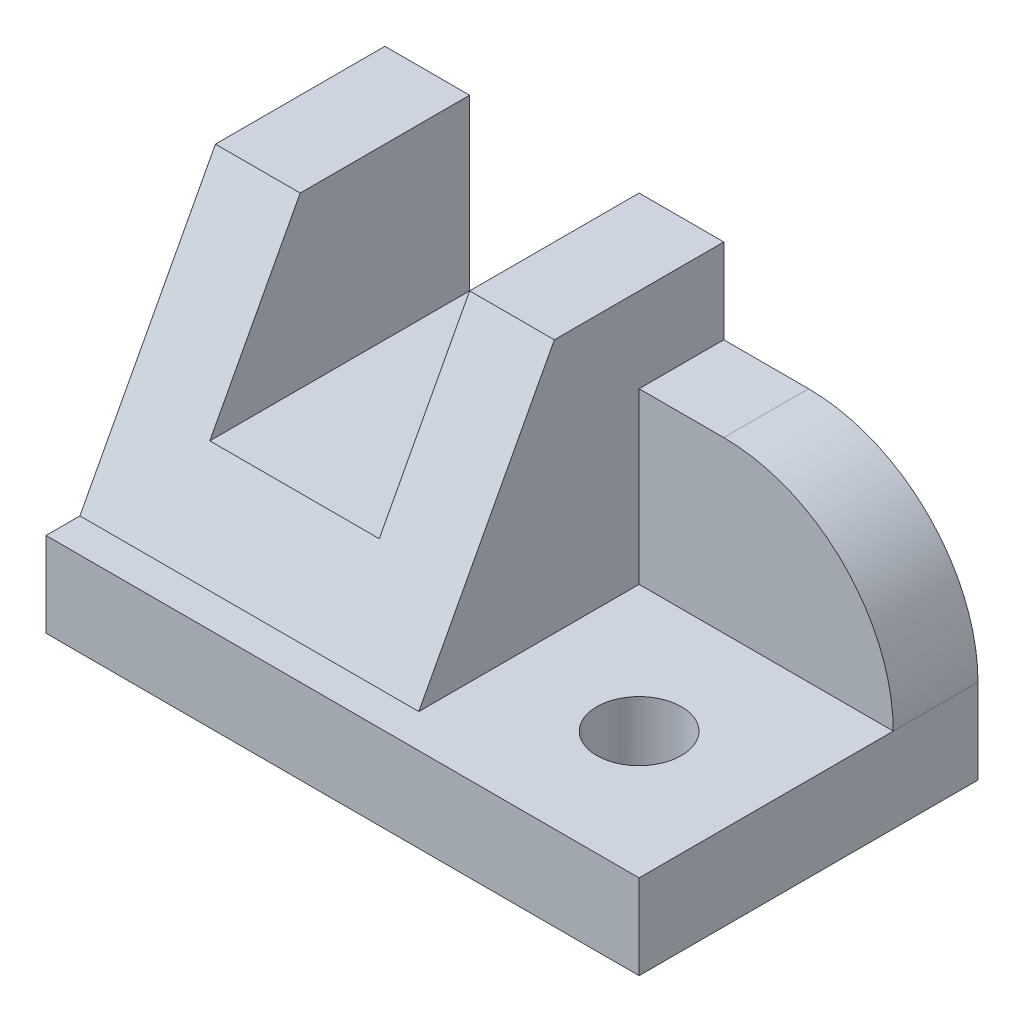
ISO-10303-21;
HEADER;
FILE_DESCRIPTION(('STEP AP214'),'2;1');
FILE_NAME('part.step','',(''),(''),'','','');
FILE_SCHEMA(('AUTOMOTIVE_DESIGN { 1 0 10303 214 1 1 1 1 }'));
ENDSEC;
DATA;
#1=APPLICATION_CONTEXT('core data for automotive mechanical design processes');
#2=APPLICATION_PROTOCOL_DEFINITION('international standard','automotive_design',2000,#1);
#3=PRODUCT_CONTEXT('',#1,'mechanical');
#4=PRODUCT('Part','Part','',(#3));
#5=PRODUCT_RELATED_PRODUCT_CATEGORY('part','',(#4));
#6=PRODUCT_DEFINITION_FORMATION('','',#4);
#7=PRODUCT_DEFINITION_CONTEXT('part definition',#1,'design');
#8=PRODUCT_DEFINITION('design','',#6,#7);
#9=PRODUCT_DEFINITION_SHAPE('','',#8);
#10=(LENGTH_UNIT() NAMED_UNIT(*) SI_UNIT(.MILLI.,.METRE.));
#11=(NAMED_UNIT(*) PLANE_ANGLE_UNIT() SI_UNIT($,.RADIAN.));
#12=(NAMED_UNIT(*) SI_UNIT($,.STERADIAN.) SOLID_ANGLE_UNIT());
#13=UNCERTAINTY_MEASURE_WITH_UNIT(LENGTH_MEASURE(1.E-05),#10,'distance_accuracy_value','');
#14=(GEOMETRIC_REPRESENTATION_CONTEXT(3) GLOBAL_UNCERTAINTY_ASSIGNED_CONTEXT((#13)) GLOBAL_UNIT_ASSIGNED_CONTEXT((#10,
#11,#12)) REPRESENTATION_CONTEXT('',''));
#15=CARTESIAN_POINT('',(0.,0.,0.));
#16=DIRECTION('',(0.,0.,1.));
#17=DIRECTION('',(1.,0.,0.));
#18=AXIS2_PLACEMENT_3D('',#15,#16,#17);
#19=CARTESIAN_POINT('',(40.,40.,-40.));
#20=DIRECTION('',(0.,-1.,0.));
#21=DIRECTION('',(0.,0.,-1.));
#22=AXIS2_PLACEMENT_3D('',#19,#20,#21);
#23=PLANE('',#22);
#24=DIRECTION('',(-1.,0.,0.));
#25=VECTOR('',#24,1.);
#26=CARTESIAN_POINT('',(40.,40.,-20.));
#27=LINE('',#26,#25);
#28=CARTESIAN_POINT('',(9.99999999999998,40.,-20.));
#29=VERTEX_POINT('',#28);
#30=CARTESIAN_POINT('',(0.,40.,-20.));
#31=VERTEX_POINT('',#30);
#32=EDGE_CURVE('E235',#29,#31,#27,.T.);
#33=ORIENTED_EDGE('',*,*,#32,.F.);
#34=DIRECTION('',(0.,0.,-1.));
#35=VECTOR('',#34,1.);
#36=CARTESIAN_POINT('',(9.99999999999998,40.,0.));
#37=LINE('',#36,#35);
#38=CARTESIAN_POINT('',(9.99999999999999,40.,-40.));
#39=VERTEX_POINT('',#38);
#40=EDGE_CURVE('E160',#29,#39,#37,.T.);
#41=ORIENTED_EDGE('',*,*,#40,.T.);
#42=DIRECTION('',(1.,0.,0.));
#43=VECTOR('',#42,1.);
#44=CARTESIAN_POINT('',(40.,40.,-40.));
#45=LINE('',#44,#43);
#46=CARTESIAN_POINT('',(0.,40.,-40.));
#47=VERTEX_POINT('',#46);
#48=EDGE_CURVE('E219',#47,#39,#45,.T.);
#49=ORIENTED_EDGE('',*,*,#48,.F.);
#50=DIRECTION('',(0.,0.,1.));
#51=VECTOR('',#50,1.);
#52=CARTESIAN_POINT('',(0.,40.,-40.));
#53=LINE('',#52,#51);
#54=EDGE_CURVE('E221',#47,#31,#53,.T.);
#55=ORIENTED_EDGE('',*,*,#54,.T.);
#56=EDGE_LOOP('',(#33,#41,#49,#55));
#57=FACE_BOUND('',#56,.T.);
#58=ADVANCED_FACE('F35',(#57),#23,.F.);
#59=CARTESIAN_POINT('',(40.,10.,-4.00000000000001));
#60=DIRECTION('',(0.,0.470588235294118,0.882352941176471));
#61=DIRECTION('',(0.,-0.882352941176471,0.470588235294118));
#62=AXIS2_PLACEMENT_3D('',#59,#60,#61);
#63=PLANE('',#62);
#64=DIRECTION('',(0.,-0.882352941176471,0.470588235294118));
#65=VECTOR('',#64,1.);
#66=CARTESIAN_POINT('',(9.99999999999998,10.,-4.00000000000002));
#67=LINE('',#66,#65);
#68=CARTESIAN_POINT('',(9.99999999999998,20.,-9.33333333333334));
#69=VERTEX_POINT('',#68);
#70=EDGE_CURVE('E168',#29,#69,#67,.T.);
#71=ORIENTED_EDGE('',*,*,#70,.F.);
#72=ORIENTED_EDGE('',*,*,#32,.T.);
#73=DIRECTION('',(0.,0.882352941176471,-0.470588235294118));
#74=VECTOR('',#73,1.);
#75=CARTESIAN_POINT('',(0.,10.,-4.00000000000001));
#76=LINE('',#75,#74);
#77=CARTESIAN_POINT('',(0.,10.,-4.00000000000001));
#78=VERTEX_POINT('',#77);
#79=EDGE_CURVE('E224',#78,#31,#76,.T.);
#80=ORIENTED_EDGE('',*,*,#79,.F.);
#81=DIRECTION('',(-1.,0.,0.));
#82=VECTOR('',#81,1.);
#83=CARTESIAN_POINT('',(40.,10.,-4.00000000000001));
#84=LINE('',#83,#82);
#85=CARTESIAN_POINT('',(40.,10.,-4.00000000000002));
#86=VERTEX_POINT('',#85);
#87=EDGE_CURVE('E228',#86,#78,#84,.T.);
#88=ORIENTED_EDGE('',*,*,#87,.F.);
#89=DIRECTION('',(0.,0.882352941176471,-0.470588235294118));
#90=VECTOR('',#89,1.);
#91=CARTESIAN_POINT('',(40.,10.,-4.00000000000001));
#92=LINE('',#91,#90);
#93=CARTESIAN_POINT('',(40.,40.,-20.));
#94=VERTEX_POINT('',#93);
#95=EDGE_CURVE('E225',#86,#94,#92,.T.);
#96=ORIENTED_EDGE('',*,*,#95,.T.);
#97=CARTESIAN_POINT('',(30.,40.,-20.));
#98=VERTEX_POINT('',#97);
#99=EDGE_CURVE('E231',#94,#98,#27,.T.);
#100=ORIENTED_EDGE('',*,*,#99,.T.);
#101=DIRECTION('',(0.,0.882352941176471,-0.470588235294118));
#102=VECTOR('',#101,1.);
#103=CARTESIAN_POINT('',(30.,10.,-4.00000000000001));
#104=LINE('',#103,#102);
#105=CARTESIAN_POINT('',(30.,20.,-9.33333333333334));
#106=VERTEX_POINT('',#105);
#107=EDGE_CURVE('E163',#106,#98,#104,.T.);
#108=ORIENTED_EDGE('',*,*,#107,.F.);
#109=DIRECTION('',(1.,0.,0.));
#110=VECTOR('',#109,1.);
#111=CARTESIAN_POINT('',(40.,20.,-9.33333333333334));
#112=LINE('',#111,#110);
#113=EDGE_CURVE('E140',#69,#106,#112,.T.);
#114=ORIENTED_EDGE('',*,*,#113,.F.);
#115=EDGE_LOOP('',(#71,#72,#80,#88,#96,#100,#108,#114));
#116=FACE_BOUND('',#115,.T.);
#117=ADVANCED_FACE('F270',(#116),#63,.T.);
#118=CARTESIAN_POINT('',(0.,0.,0.));
#119=DIRECTION('',(1.,0.,0.));
#120=DIRECTION('',(0.,0.,-1.));
#121=AXIS2_PLACEMENT_3D('',#118,#119,#120);
#122=PLANE('',#121);
#123=DIRECTION('',(0.,1.,0.));
#124=VECTOR('',#123,1.);
#125=CARTESIAN_POINT('',(0.,40.,-40.));
#126=LINE('',#125,#124);
#127=CARTESIAN_POINT('',(0.,0.,-40.));
#128=VERTEX_POINT('',#127);
#129=EDGE_CURVE('E216',#128,#47,#126,.T.);
#130=ORIENTED_EDGE('',*,*,#129,.F.);
#131=DIRECTION('',(0.,0.,-1.));
#132=VECTOR('',#131,1.);
#133=CARTESIAN_POINT('',(0.,0.,-40.));
#134=LINE('',#133,#132);
#135=CARTESIAN_POINT('',(0.,0.,0.));
#136=VERTEX_POINT('',#135);
#137=EDGE_CURVE('E174',#136,#128,#134,.T.);
#138=ORIENTED_EDGE('',*,*,#137,.F.);
#139=DIRECTION('',(0.,1.,0.));
#140=VECTOR('',#139,1.);
#141=CARTESIAN_POINT('',(0.,0.,0.));
#142=LINE('',#141,#140);
#143=CARTESIAN_POINT('',(0.,10.,0.));
#144=VERTEX_POINT('',#143);
#145=EDGE_CURVE('E192',#136,#144,#142,.T.);
#146=ORIENTED_EDGE('',*,*,#145,.T.);
#147=DIRECTION('',(0.,0.,-1.));
#148=VECTOR('',#147,1.);
#149=CARTESIAN_POINT('',(0.,10.,-40.));
#150=LINE('',#149,#148);
#151=EDGE_CURVE('E186',#144,#78,#150,.T.);
#152=ORIENTED_EDGE('',*,*,#151,.T.);
#153=ORIENTED_EDGE('',*,*,#79,.T.);
#154=ORIENTED_EDGE('',*,*,#54,.F.);
#155=EDGE_LOOP('',(#130,#138,#146,#152,#153,#154));
#156=FACE_BOUND('',#155,.T.);
#157=ADVANCED_FACE('F273',(#156),#122,.F.);
#158=CARTESIAN_POINT('',(30.,40.,-40.));
#159=VERTEX_POINT('',#158);
#160=CARTESIAN_POINT('',(40.,40.,-40.));
#161=VERTEX_POINT('',#160);
#162=EDGE_CURVE('E218',#159,#161,#45,.T.);
#163=ORIENTED_EDGE('',*,*,#162,.F.);
#164=DIRECTION('',(0.,0.,-1.));
#165=VECTOR('',#164,1.);
#166=CARTESIAN_POINT('',(30.,40.,0.));
#167=LINE('',#166,#165);
#168=EDGE_CURVE('E144',#98,#159,#167,.T.);
#169=ORIENTED_EDGE('',*,*,#168,.F.);
#170=ORIENTED_EDGE('',*,*,#99,.F.);
#171=DIRECTION('',(0.,0.,1.));
#172=VECTOR('',#171,1.);
#173=CARTESIAN_POINT('',(40.,40.,-40.));
#174=LINE('',#173,#172);
#175=EDGE_CURVE('E195',#161,#94,#174,.T.);
#176=ORIENTED_EDGE('',*,*,#175,.F.);
#177=EDGE_LOOP('',(#163,#169,#170,#176));
#178=FACE_BOUND('',#177,.T.);
#179=ADVANCED_FACE('F267',(#178),#23,.F.);
#180=CARTESIAN_POINT('',(0.,0.,-40.));
#181=DIRECTION('',(0.,0.,1.));
#182=DIRECTION('',(0.,-1.,0.));
#183=AXIS2_PLACEMENT_3D('',#180,#181,#182);
#184=PLANE('',#183);
#185=DIRECTION('',(1.,0.,0.));
#186=VECTOR('',#185,1.);
#187=CARTESIAN_POINT('',(40.,30.,-40.));
#188=LINE('',#187,#186);
#189=CARTESIAN_POINT('',(40.,30.,-40.));
#190=VERTEX_POINT('',#189);
#191=CARTESIAN_POINT('',(50.,30.,-40.));
#192=VERTEX_POINT('',#191);
#193=EDGE_CURVE('E209',#190,#192,#188,.T.);
#194=ORIENTED_EDGE('',*,*,#193,.T.);
#195=CARTESIAN_POINT('',(50.,9.99999999999999,-40.));
#196=DIRECTION('',(0.,0.,1.));
#197=DIRECTION('',(0.,-1.,0.));
#198=AXIS2_PLACEMENT_3D('',#195,#196,#197);
#199=CIRCLE('',#198,20.);
#200=CARTESIAN_POINT('',(70.,10.,-40.));
#201=VERTEX_POINT('',#200);
#202=EDGE_CURVE('E50',#192,#201,#199,.F.);
#203=ORIENTED_EDGE('',*,*,#202,.T.);
#204=DIRECTION('',(0.,1.,0.));
#205=VECTOR('',#204,1.);
#206=CARTESIAN_POINT('',(70.,40.,-40.));
#207=LINE('',#206,#205);
#208=CARTESIAN_POINT('',(70.,0.,-40.));
#209=VERTEX_POINT('',#208);
#210=EDGE_CURVE('E211',#209,#201,#207,.T.);
#211=ORIENTED_EDGE('',*,*,#210,.F.);
#212=DIRECTION('',(1.,0.,0.));
#213=VECTOR('',#212,1.);
#214=CARTESIAN_POINT('',(70.,0.,-40.));
#215=LINE('',#214,#213);
#216=EDGE_CURVE('E178',#128,#209,#215,.T.);
#217=ORIENTED_EDGE('',*,*,#216,.F.);
#218=ORIENTED_EDGE('',*,*,#129,.T.);
#219=ORIENTED_EDGE('',*,*,#48,.T.);
#220=DIRECTION('',(0.,1.,0.));
#221=VECTOR('',#220,1.);
#222=CARTESIAN_POINT('',(9.99999999999999,20.,-40.));
#223=LINE('',#222,#221);
#224=CARTESIAN_POINT('',(9.99999999999999,20.,-40.));
#225=VERTEX_POINT('',#224);
#226=EDGE_CURVE('E155',#225,#39,#223,.T.);
#227=ORIENTED_EDGE('',*,*,#226,.F.);
#228=DIRECTION('',(-1.,0.,0.));
#229=VECTOR('',#228,1.);
#230=CARTESIAN_POINT('',(30.,20.,-40.));
#231=LINE('',#230,#229);
#232=CARTESIAN_POINT('',(30.,20.,-40.));
#233=VERTEX_POINT('',#232);
#234=EDGE_CURVE('E137',#233,#225,#231,.T.);
#235=ORIENTED_EDGE('',*,*,#234,.F.);
#236=DIRECTION('',(0.,-1.,0.));
#237=VECTOR('',#236,1.);
#238=CARTESIAN_POINT('',(30.,40.,-40.));
#239=LINE('',#238,#237);
#240=EDGE_CURVE('E147',#159,#233,#239,.T.);
#241=ORIENTED_EDGE('',*,*,#240,.F.);
#242=ORIENTED_EDGE('',*,*,#162,.T.);
#243=DIRECTION('',(0.,1.,0.));
#244=VECTOR('',#243,1.);
#245=CARTESIAN_POINT('',(40.,30.,-40.));
#246=LINE('',#245,#244);
#247=EDGE_CURVE('E205',#190,#161,#246,.T.);
#248=ORIENTED_EDGE('',*,*,#247,.F.);
#249=EDGE_LOOP('',(#194,#203,#211,#217,#218,#219,#227,#235,#241,#242,#248));
#250=FACE_BOUND('',#249,.T.);
#251=ADVANCED_FACE('F153',(#250),#184,.F.);
#252=CARTESIAN_POINT('',(70.,0.,0.));
#253=DIRECTION('',(-1.,0.,0.));
#254=DIRECTION('',(0.,0.,1.));
#255=AXIS2_PLACEMENT_3D('',#252,#253,#254);
#256=PLANE('',#255);
#257=ORIENTED_EDGE('',*,*,#210,.T.);
#258=DIRECTION('',(0.,0.,-1.));
#259=VECTOR('',#258,1.);
#260=CARTESIAN_POINT('',(70.,9.99999999999999,0.));
#261=LINE('',#260,#259);
#262=CARTESIAN_POINT('',(70.,10.,-30.));
#263=VERTEX_POINT('',#262);
#264=EDGE_CURVE('E43',#201,#263,#261,.F.);
#265=ORIENTED_EDGE('',*,*,#264,.T.);
#266=DIRECTION('',(0.,0.,1.));
#267=VECTOR('',#266,1.);
#268=CARTESIAN_POINT('',(70.,10.,0.));
#269=LINE('',#268,#267);
#270=CARTESIAN_POINT('',(70.,10.,0.));
#271=VERTEX_POINT('',#270);
#272=EDGE_CURVE('E175',#263,#271,#269,.T.);
#273=ORIENTED_EDGE('',*,*,#272,.T.);
#274=DIRECTION('',(0.,1.,0.));
#275=VECTOR('',#274,1.);
#276=CARTESIAN_POINT('',(70.,0.,0.));
#277=LINE('',#276,#275);
#278=CARTESIAN_POINT('',(70.,0.,0.));
#279=VERTEX_POINT('',#278);
#280=EDGE_CURVE('E183',#279,#271,#277,.T.);
#281=ORIENTED_EDGE('',*,*,#280,.F.);
#282=DIRECTION('',(0.,0.,1.));
#283=VECTOR('',#282,1.);
#284=CARTESIAN_POINT('',(70.,0.,0.));
#285=LINE('',#284,#283);
#286=EDGE_CURVE('E181',#209,#279,#285,.T.);
#287=ORIENTED_EDGE('',*,*,#286,.F.);
#288=EDGE_LOOP('',(#257,#265,#273,#281,#287));
#289=FACE_BOUND('',#288,.T.);
#290=ADVANCED_FACE('F245',(#289),#256,.F.);
#291=CARTESIAN_POINT('',(40.,30.,-30.));
#292=DIRECTION('',(0.,-1.,0.));
#293=DIRECTION('',(0.,0.,-1.));
#294=AXIS2_PLACEMENT_3D('',#291,#292,#293);
#295=PLANE('',#294);
#296=DIRECTION('',(1.,0.,0.));
#297=VECTOR('',#296,1.);
#298=CARTESIAN_POINT('',(40.,30.,-30.));
#299=LINE('',#298,#297);
#300=CARTESIAN_POINT('',(40.,30.,-30.));
#301=VERTEX_POINT('',#300);
#302=CARTESIAN_POINT('',(50.,30.,-30.));
#303=VERTEX_POINT('',#302);
#304=EDGE_CURVE('E212',#301,#303,#299,.T.);
#305=ORIENTED_EDGE('',*,*,#304,.T.);
#306=DIRECTION('',(0.,0.,-1.));
#307=VECTOR('',#306,1.);
#308=CARTESIAN_POINT('',(50.,30.,-30.));
#309=LINE('',#308,#307);
#310=EDGE_CURVE('E234',#303,#192,#309,.T.);
#311=ORIENTED_EDGE('',*,*,#310,.T.);
#312=ORIENTED_EDGE('',*,*,#193,.F.);
#313=DIRECTION('',(0.,0.,-1.));
#314=VECTOR('',#313,1.);
#315=CARTESIAN_POINT('',(40.,30.,-30.));
#316=LINE('',#315,#314);
#317=EDGE_CURVE('E202',#301,#190,#316,.T.);
#318=ORIENTED_EDGE('',*,*,#317,.F.);
#319=EDGE_LOOP('',(#305,#311,#312,#318));
#320=FACE_BOUND('',#319,.T.);
#321=ADVANCED_FACE('F259',(#320),#295,.F.);
#322=CARTESIAN_POINT('',(40.,10.,-30.));
#323=DIRECTION('',(0.,0.,-1.));
#324=DIRECTION('',(-1.,0.,0.));
#325=AXIS2_PLACEMENT_3D('',#322,#323,#324);
#326=PLANE('',#325);
#327=DIRECTION('',(1.,0.,0.));
#328=VECTOR('',#327,1.);
#329=CARTESIAN_POINT('',(40.,10.,-30.));
#330=LINE('',#329,#328);
#331=CARTESIAN_POINT('',(40.,10.,-30.));
#332=VERTEX_POINT('',#331);
#333=EDGE_CURVE('E208',#332,#263,#330,.T.);
#334=ORIENTED_EDGE('',*,*,#333,.T.);
#335=CARTESIAN_POINT('',(50.,9.99999999999999,-30.));
#336=DIRECTION('',(0.,0.,-1.));
#337=DIRECTION('',(-1.,0.,0.));
#338=AXIS2_PLACEMENT_3D('',#335,#336,#337);
#339=CIRCLE('',#338,20.);
#340=EDGE_CURVE('E11',#263,#303,#339,.F.);
#341=ORIENTED_EDGE('',*,*,#340,.T.);
#342=ORIENTED_EDGE('',*,*,#304,.F.);
#343=DIRECTION('',(0.,1.,0.));
#344=VECTOR('',#343,1.);
#345=CARTESIAN_POINT('',(40.,10.,-30.));
#346=LINE('',#345,#344);
#347=EDGE_CURVE('E199',#332,#301,#346,.T.);
#348=ORIENTED_EDGE('',*,*,#347,.F.);
#349=EDGE_LOOP('',(#334,#341,#342,#348));
#350=FACE_BOUND('',#349,.T.);
#351=ADVANCED_FACE('F252',(#350),#326,.F.);
#352=CARTESIAN_POINT('',(40.,0.,0.));
#353=DIRECTION('',(-1.,0.,0.));
#354=DIRECTION('',(0.,0.,1.));
#355=AXIS2_PLACEMENT_3D('',#352,#353,#354);
#356=PLANE('',#355);
#357=ORIENTED_EDGE('',*,*,#95,.F.);
#358=DIRECTION('',(0.,0.,-1.));
#359=VECTOR('',#358,1.);
#360=CARTESIAN_POINT('',(40.,10.,0.));
#361=LINE('',#360,#359);
#362=EDGE_CURVE('E197',#86,#332,#361,.T.);
#363=ORIENTED_EDGE('',*,*,#362,.T.);
#364=ORIENTED_EDGE('',*,*,#347,.T.);
#365=ORIENTED_EDGE('',*,*,#317,.T.);
#366=ORIENTED_EDGE('',*,*,#247,.T.);
#367=ORIENTED_EDGE('',*,*,#175,.T.);
#368=EDGE_LOOP('',(#357,#363,#364,#365,#366,#367));
#369=FACE_BOUND('',#368,.T.);
#370=ADVANCED_FACE('F264',(#369),#356,.F.);
#371=CARTESIAN_POINT('',(0.,10.,0.));
#372=DIRECTION('',(0.,1.,0.));
#373=DIRECTION('',(0.,0.,1.));
#374=AXIS2_PLACEMENT_3D('',#371,#372,#373);
#375=PLANE('',#374);
#376=CARTESIAN_POINT('',(55.,10.,-15.));
#377=DIRECTION('',(0.,1.,0.));
#378=DIRECTION('',(0.,0.,1.));
#379=AXIS2_PLACEMENT_3D('',#376,#377,#378);
#380=CIRCLE('',#379,4.99999999999998);
#381=CARTESIAN_POINT('',(55.,10.,-10.));
#382=VERTEX_POINT('',#381);
#383=EDGE_CURVE('E151',#382,#382,#380,.T.);
#384=ORIENTED_EDGE('',*,*,#383,.F.);
#385=EDGE_LOOP('',(#384));
#386=FACE_BOUND('',#385,.T.);
#387=ORIENTED_EDGE('',*,*,#333,.F.);
#388=ORIENTED_EDGE('',*,*,#362,.F.);
#389=ORIENTED_EDGE('',*,*,#87,.T.);
#390=ORIENTED_EDGE('',*,*,#151,.F.);
#391=DIRECTION('',(-1.,0.,0.));
#392=VECTOR('',#391,1.);
#393=CARTESIAN_POINT('',(0.,10.,0.));
#394=LINE('',#393,#392);
#395=EDGE_CURVE('E170',#271,#144,#394,.T.);
#396=ORIENTED_EDGE('',*,*,#395,.F.);
#397=ORIENTED_EDGE('',*,*,#272,.F.);
#398=EDGE_LOOP('',(#387,#388,#389,#390,#396,#397));
#399=FACE_BOUND('',#398,.T.);
#400=ADVANCED_FACE('F256',(#386,#399),#375,.T.);
#401=CARTESIAN_POINT('',(0.,0.,0.));
#402=DIRECTION('',(0.,0.,-1.));
#403=DIRECTION('',(-1.,0.,0.));
#404=AXIS2_PLACEMENT_3D('',#401,#402,#403);
#405=PLANE('',#404);
#406=ORIENTED_EDGE('',*,*,#395,.T.);
#407=ORIENTED_EDGE('',*,*,#145,.F.);
#408=DIRECTION('',(-1.,0.,0.));
#409=VECTOR('',#408,1.);
#410=CARTESIAN_POINT('',(0.,0.,0.));
#411=LINE('',#410,#409);
#412=EDGE_CURVE('E171',#279,#136,#411,.T.);
#413=ORIENTED_EDGE('',*,*,#412,.F.);
#414=ORIENTED_EDGE('',*,*,#280,.T.);
#415=EDGE_LOOP('',(#406,#407,#413,#414));
#416=FACE_BOUND('',#415,.T.);
#417=ADVANCED_FACE('F278',(#416),#405,.F.);
#418=CARTESIAN_POINT('',(0.,0.,0.));
#419=DIRECTION('',(0.,1.,0.));
#420=DIRECTION('',(0.,0.,1.));
#421=AXIS2_PLACEMENT_3D('',#418,#419,#420);
#422=PLANE('',#421);
#423=CARTESIAN_POINT('',(55.,0.,-15.));
#424=DIRECTION('',(0.,-1.,0.));
#425=DIRECTION('',(0.,0.,-1.));
#426=AXIS2_PLACEMENT_3D('',#423,#424,#425);
#427=CIRCLE('',#426,4.99999999999998);
#428=CARTESIAN_POINT('',(55.,0.,-20.));
#429=VERTEX_POINT('',#428);
#430=EDGE_CURVE('E240',#429,#429,#427,.T.);
#431=ORIENTED_EDGE('',*,*,#430,.F.);
#432=EDGE_LOOP('',(#431));
#433=FACE_BOUND('',#432,.T.);
#434=ORIENTED_EDGE('',*,*,#412,.T.);
#435=ORIENTED_EDGE('',*,*,#137,.T.);
#436=ORIENTED_EDGE('',*,*,#216,.T.);
#437=ORIENTED_EDGE('',*,*,#286,.T.);
#438=EDGE_LOOP('',(#434,#435,#436,#437));
#439=FACE_BOUND('',#438,.T.);
#440=ADVANCED_FACE('F280',(#433,#439),#422,.F.);
#441=CARTESIAN_POINT('',(9.99999999999998,20.,0.));
#442=DIRECTION('',(-1.,0.,0.));
#443=DIRECTION('',(0.,0.,1.));
#444=AXIS2_PLACEMENT_3D('',#441,#442,#443);
#445=PLANE('',#444);
#446=ORIENTED_EDGE('',*,*,#70,.T.);
#447=DIRECTION('',(0.,0.,-1.));
#448=VECTOR('',#447,1.);
#449=CARTESIAN_POINT('',(9.99999999999998,20.,0.));
#450=LINE('',#449,#448);
#451=EDGE_CURVE('E143',#69,#225,#450,.T.);
#452=ORIENTED_EDGE('',*,*,#451,.T.);
#453=ORIENTED_EDGE('',*,*,#226,.T.);
#454=ORIENTED_EDGE('',*,*,#40,.F.);
#455=EDGE_LOOP('',(#446,#452,#453,#454));
#456=FACE_BOUND('',#455,.T.);
#457=ADVANCED_FACE('F286',(#456),#445,.F.);
#458=CARTESIAN_POINT('',(30.,20.,0.));
#459=DIRECTION('',(0.,-1.,0.));
#460=DIRECTION('',(0.,0.,-1.));
#461=AXIS2_PLACEMENT_3D('',#458,#459,#460);
#462=PLANE('',#461);
#463=ORIENTED_EDGE('',*,*,#113,.T.);
#464=DIRECTION('',(0.,0.,-1.));
#465=VECTOR('',#464,1.);
#466=CARTESIAN_POINT('',(30.,20.,0.));
#467=LINE('',#466,#465);
#468=EDGE_CURVE('E132',#106,#233,#467,.T.);
#469=ORIENTED_EDGE('',*,*,#468,.T.);
#470=ORIENTED_EDGE('',*,*,#234,.T.);
#471=ORIENTED_EDGE('',*,*,#451,.F.);
#472=EDGE_LOOP('',(#463,#469,#470,#471));
#473=FACE_BOUND('',#472,.T.);
#474=ADVANCED_FACE('F134',(#473),#462,.F.);
#475=CARTESIAN_POINT('',(30.,40.,0.));
#476=DIRECTION('',(1.,0.,0.));
#477=DIRECTION('',(0.,0.,-1.));
#478=AXIS2_PLACEMENT_3D('',#475,#476,#477);
#479=PLANE('',#478);
#480=ORIENTED_EDGE('',*,*,#107,.T.);
#481=ORIENTED_EDGE('',*,*,#168,.T.);
#482=ORIENTED_EDGE('',*,*,#240,.T.);
#483=ORIENTED_EDGE('',*,*,#468,.F.);
#484=EDGE_LOOP('',(#480,#481,#482,#483));
#485=FACE_BOUND('',#484,.T.);
#486=ADVANCED_FACE('F148',(#485),#479,.F.);
#487=CARTESIAN_POINT('',(55.,0.,-15.));
#488=DIRECTION('',(0.,-1.,0.));
#489=DIRECTION('',(0.,0.,-1.));
#490=AXIS2_PLACEMENT_3D('',#487,#488,#489);
#491=CYLINDRICAL_SURFACE('',#490,4.99999999999998);
#492=ORIENTED_EDGE('',*,*,#383,.T.);
#493=EDGE_LOOP('',(#492));
#494=FACE_BOUND('',#493,.T.);
#495=ORIENTED_EDGE('',*,*,#430,.T.);
#496=EDGE_LOOP('',(#495));
#497=FACE_BOUND('',#496,.T.);
#498=ADVANCED_FACE('F346',(#494,#497),#491,.F.);
#499=CARTESIAN_POINT('',(50.,9.99999999999999,-30.));
#500=DIRECTION('',(0.,0.,-1.));
#501=DIRECTION('',(-1.,0.,0.));
#502=AXIS2_PLACEMENT_3D('',#499,#500,#501);
#503=CYLINDRICAL_SURFACE('',#502,20.);
#504=ORIENTED_EDGE('',*,*,#340,.F.);
#505=ORIENTED_EDGE('',*,*,#264,.F.);
#506=ORIENTED_EDGE('',*,*,#202,.F.);
#507=ORIENTED_EDGE('',*,*,#310,.F.);
#508=EDGE_LOOP('',(#504,#505,#506,#507));
#509=FACE_BOUND('',#508,.T.);
#510=ADVANCED_FACE('F37',(#509),#503,.T.);
#511=CLOSED_SHELL('',(#58,#117,#157,#179,#251,#290,#321,#351,#370,#400,#417,#440,#457,#474,#486,
#498,#510));
#512=MANIFOLD_SOLID_BREP('B2',#511);
#513=ADVANCED_BREP_SHAPE_REPRESENTATION('',(#18,#512),#14);
#514=SHAPE_DEFINITION_REPRESENTATION(#9,#513);
ENDSEC;
END-ISO-10303-21;
